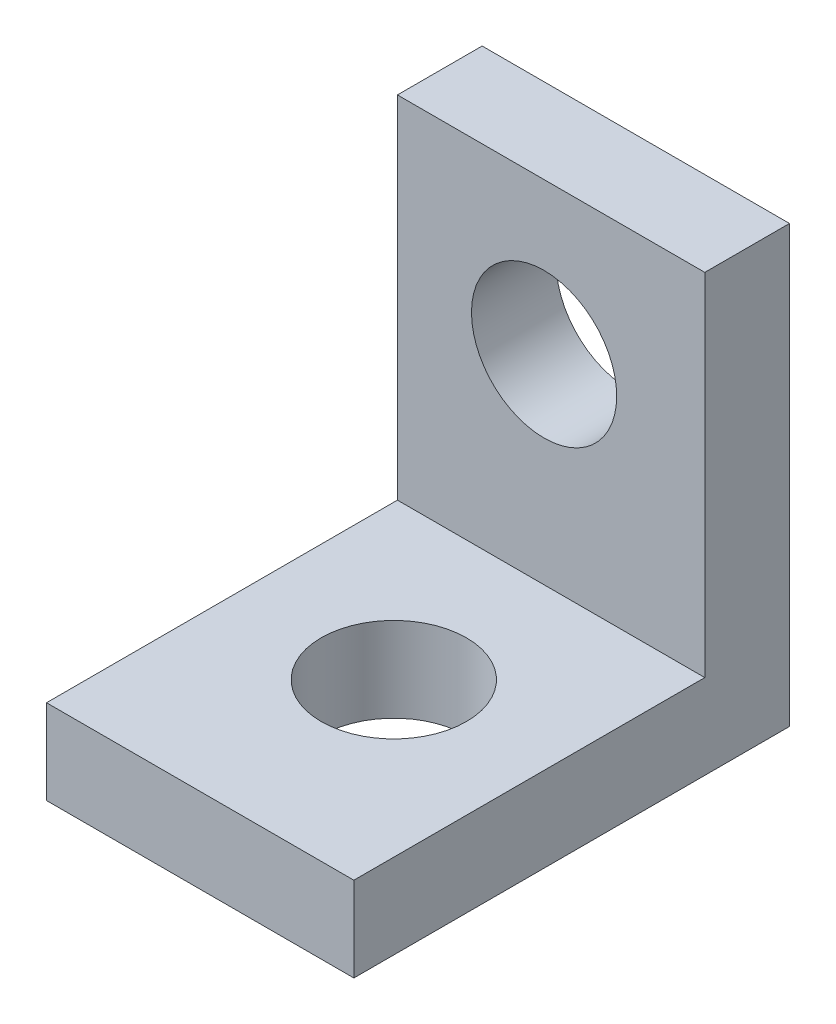
ISO-10303-21;
HEADER;
FILE_DESCRIPTION(('STEP AP214'),'2;1');
FILE_NAME('part.step','',(''),(''),'','','');
FILE_SCHEMA(('AUTOMOTIVE_DESIGN { 1 0 10303 214 1 1 1 1 }'));
ENDSEC;
DATA;
#1=APPLICATION_CONTEXT('core data for automotive mechanical design processes');
#2=APPLICATION_PROTOCOL_DEFINITION('international standard','automotive_design',2000,#1);
#3=PRODUCT_CONTEXT('',#1,'mechanical');
#4=PRODUCT('Part','Part','',(#3));
#5=PRODUCT_RELATED_PRODUCT_CATEGORY('part','',(#4));
#6=PRODUCT_DEFINITION_FORMATION('','',#4);
#7=PRODUCT_DEFINITION_CONTEXT('part definition',#1,'design');
#8=PRODUCT_DEFINITION('design','',#6,#7);
#9=PRODUCT_DEFINITION_SHAPE('','',#8);
#10=(LENGTH_UNIT() NAMED_UNIT(*) SI_UNIT(.MILLI.,.METRE.));
#11=(NAMED_UNIT(*) PLANE_ANGLE_UNIT() SI_UNIT($,.RADIAN.));
#12=(NAMED_UNIT(*) SI_UNIT($,.STERADIAN.) SOLID_ANGLE_UNIT());
#13=UNCERTAINTY_MEASURE_WITH_UNIT(LENGTH_MEASURE(1.E-05),#10,'distance_accuracy_value','');
#14=(GEOMETRIC_REPRESENTATION_CONTEXT(3) GLOBAL_UNCERTAINTY_ASSIGNED_CONTEXT((#13)) GLOBAL_UNIT_ASSIGNED_CONTEXT((#10,
#11,#12)) REPRESENTATION_CONTEXT('',''));
#15=CARTESIAN_POINT('',(0.,0.,0.));
#16=DIRECTION('',(0.,0.,1.));
#17=DIRECTION('',(1.,0.,0.));
#18=AXIS2_PLACEMENT_3D('',#15,#16,#17);
#19=CARTESIAN_POINT('',(0.,1.75,0.));
#20=DIRECTION('',(0.,1.,0.));
#21=DIRECTION('',(0.,0.,1.));
#22=AXIS2_PLACEMENT_3D('',#19,#20,#21);
#23=PLANE('',#22);
#24=DIRECTION('',(1.,0.,0.));
#25=VECTOR('',#24,1.);
#26=CARTESIAN_POINT('',(-0.604761904761905,1.75,-0.291071428571429));
#27=LINE('',#26,#25);
#28=CARTESIAN_POINT('',(-0.604761904761905,1.75,-0.291071428571429));
#29=VERTEX_POINT('',#28);
#30=CARTESIAN_POINT('',(5.74523809523809,1.75,-0.291071428571429));
#31=VERTEX_POINT('',#30);
#32=EDGE_CURVE('E56',#29,#31,#27,.T.);
#33=ORIENTED_EDGE('',*,*,#32,.F.);
#34=DIRECTION('',(0.,0.,1.));
#35=VECTOR('',#34,1.);
#36=CARTESIAN_POINT('',(-0.604761904761906,1.75,-2.04107142857143));
#37=LINE('',#36,#35);
#38=CARTESIAN_POINT('',(-0.604761904761905,1.75,6.95892857142857));
#39=VERTEX_POINT('',#38);
#40=EDGE_CURVE('E94',#29,#39,#37,.T.);
#41=ORIENTED_EDGE('',*,*,#40,.T.);
#42=DIRECTION('',(1.,0.,0.));
#43=VECTOR('',#42,1.);
#44=CARTESIAN_POINT('',(-0.604761904761905,1.75,6.95892857142857));
#45=LINE('',#44,#43);
#46=CARTESIAN_POINT('',(5.7452380952381,1.75,6.95892857142857));
#47=VERTEX_POINT('',#46);
#48=EDGE_CURVE('E62',#39,#47,#45,.T.);
#49=ORIENTED_EDGE('',*,*,#48,.T.);
#50=DIRECTION('',(0.,0.,-1.));
#51=VECTOR('',#50,1.);
#52=CARTESIAN_POINT('',(5.74523809523809,1.75,-2.04107142857143));
#53=LINE('',#52,#51);
#54=EDGE_CURVE('E106',#47,#31,#53,.T.);
#55=ORIENTED_EDGE('',*,*,#54,.T.);
#56=EDGE_LOOP('',(#33,#41,#49,#55));
#57=FACE_BOUND('',#56,.T.);
#58=CARTESIAN_POINT('',(2.57023809523809,1.75,2.95892857142857));
#59=DIRECTION('',(0.,1.,0.));
#60=DIRECTION('',(0.,0.,1.));
#61=AXIS2_PLACEMENT_3D('',#58,#59,#60);
#62=CIRCLE('',#61,1.5);
#63=CARTESIAN_POINT('',(2.57023809523809,1.75,4.45892857142857));
#64=VERTEX_POINT('',#63);
#65=EDGE_CURVE('E112',#64,#64,#62,.T.);
#66=ORIENTED_EDGE('',*,*,#65,.F.);
#67=EDGE_LOOP('',(#66));
#68=FACE_BOUND('',#67,.T.);
#69=ADVANCED_FACE('F39',(#57,#68),#23,.T.);
#70=CARTESIAN_POINT('',(0.,0.,0.));
#71=DIRECTION('',(0.,1.,0.));
#72=DIRECTION('',(0.,0.,1.));
#73=AXIS2_PLACEMENT_3D('',#70,#71,#72);
#74=PLANE('',#73);
#75=DIRECTION('',(0.,0.,1.));
#76=VECTOR('',#75,1.);
#77=CARTESIAN_POINT('',(-0.604761904761906,0.,-2.04107142857143));
#78=LINE('',#77,#76);
#79=CARTESIAN_POINT('',(-0.604761904761906,0.,-2.04107142857143));
#80=VERTEX_POINT('',#79);
#81=CARTESIAN_POINT('',(-0.604761904761905,0.,6.95892857142857));
#82=VERTEX_POINT('',#81);
#83=EDGE_CURVE('E101',#80,#82,#78,.T.);
#84=ORIENTED_EDGE('',*,*,#83,.F.);
#85=DIRECTION('',(-1.,0.,0.));
#86=VECTOR('',#85,1.);
#87=CARTESIAN_POINT('',(-0.604761904761906,0.,-2.04107142857143));
#88=LINE('',#87,#86);
#89=CARTESIAN_POINT('',(5.74523809523809,0.,-2.04107142857143));
#90=VERTEX_POINT('',#89);
#91=EDGE_CURVE('E82',#90,#80,#88,.T.);
#92=ORIENTED_EDGE('',*,*,#91,.F.);
#93=DIRECTION('',(0.,0.,-1.));
#94=VECTOR('',#93,1.);
#95=CARTESIAN_POINT('',(5.74523809523809,0.,-2.04107142857143));
#96=LINE('',#95,#94);
#97=CARTESIAN_POINT('',(5.7452380952381,0.,6.95892857142857));
#98=VERTEX_POINT('',#97);
#99=EDGE_CURVE('E95',#98,#90,#96,.T.);
#100=ORIENTED_EDGE('',*,*,#99,.F.);
#101=DIRECTION('',(1.,0.,0.));
#102=VECTOR('',#101,1.);
#103=CARTESIAN_POINT('',(-0.604761904761905,0.,6.95892857142857));
#104=LINE('',#103,#102);
#105=EDGE_CURVE('E110',#82,#98,#104,.T.);
#106=ORIENTED_EDGE('',*,*,#105,.F.);
#107=EDGE_LOOP('',(#84,#92,#100,#106));
#108=FACE_BOUND('',#107,.T.);
#109=CARTESIAN_POINT('',(2.57023809523809,0.,2.95892857142857));
#110=DIRECTION('',(0.,1.,0.));
#111=DIRECTION('',(0.,0.,1.));
#112=AXIS2_PLACEMENT_3D('',#109,#110,#111);
#113=CIRCLE('',#112,1.5);
#114=CARTESIAN_POINT('',(2.57023809523809,0.,4.45892857142857));
#115=VERTEX_POINT('',#114);
#116=EDGE_CURVE('E118',#115,#115,#113,.T.);
#117=ORIENTED_EDGE('',*,*,#116,.T.);
#118=EDGE_LOOP('',(#117));
#119=FACE_BOUND('',#118,.T.);
#120=ADVANCED_FACE('F108',(#108,#119),#74,.F.);
#121=CARTESIAN_POINT('',(-0.604761904761906,1.75,-2.04107142857143));
#122=DIRECTION('',(1.,0.,0.));
#123=DIRECTION('',(0.,0.,-1.));
#124=AXIS2_PLACEMENT_3D('',#121,#122,#123);
#125=PLANE('',#124);
#126=ORIENTED_EDGE('',*,*,#83,.T.);
#127=DIRECTION('',(0.,-1.,0.));
#128=VECTOR('',#127,1.);
#129=CARTESIAN_POINT('',(-0.604761904761905,1.75,6.95892857142857));
#130=LINE('',#129,#128);
#131=EDGE_CURVE('E11',#39,#82,#130,.T.);
#132=ORIENTED_EDGE('',*,*,#131,.F.);
#133=ORIENTED_EDGE('',*,*,#40,.F.);
#134=DIRECTION('',(0.,-1.,0.));
#135=VECTOR('',#134,1.);
#136=CARTESIAN_POINT('',(-0.604761904761905,9.,-0.291071428571429));
#137=LINE('',#136,#135);
#138=CARTESIAN_POINT('',(-0.604761904761905,9.,-0.291071428571429));
#139=VERTEX_POINT('',#138);
#140=EDGE_CURVE('E137',#139,#29,#137,.T.);
#141=ORIENTED_EDGE('',*,*,#140,.F.);
#142=DIRECTION('',(0.,0.,1.));
#143=VECTOR('',#142,1.);
#144=CARTESIAN_POINT('',(-0.604761904761906,9.,-2.04107142857143));
#145=LINE('',#144,#143);
#146=CARTESIAN_POINT('',(-0.604761904761906,9.,-2.04107142857143));
#147=VERTEX_POINT('',#146);
#148=EDGE_CURVE('E104',#147,#139,#145,.T.);
#149=ORIENTED_EDGE('',*,*,#148,.F.);
#150=DIRECTION('',(0.,-1.,0.));
#151=VECTOR('',#150,1.);
#152=CARTESIAN_POINT('',(-0.604761904761906,1.75,-2.04107142857143));
#153=LINE('',#152,#151);
#154=EDGE_CURVE('E86',#147,#80,#153,.T.);
#155=ORIENTED_EDGE('',*,*,#154,.T.);
#156=EDGE_LOOP('',(#126,#132,#133,#141,#149,#155));
#157=FACE_BOUND('',#156,.T.);
#158=ADVANCED_FACE('F41',(#157),#125,.F.);
#159=CARTESIAN_POINT('',(-0.604761904761905,1.75,6.95892857142857));
#160=DIRECTION('',(0.,0.,-1.));
#161=DIRECTION('',(-1.,0.,0.));
#162=AXIS2_PLACEMENT_3D('',#159,#160,#161);
#163=PLANE('',#162);
#164=ORIENTED_EDGE('',*,*,#105,.T.);
#165=DIRECTION('',(0.,-1.,0.));
#166=VECTOR('',#165,1.);
#167=CARTESIAN_POINT('',(5.7452380952381,1.75,6.95892857142857));
#168=LINE('',#167,#166);
#169=EDGE_CURVE('E49',#47,#98,#168,.T.);
#170=ORIENTED_EDGE('',*,*,#169,.F.);
#171=ORIENTED_EDGE('',*,*,#48,.F.);
#172=ORIENTED_EDGE('',*,*,#131,.T.);
#173=EDGE_LOOP('',(#164,#170,#171,#172));
#174=FACE_BOUND('',#173,.T.);
#175=ADVANCED_FACE('F134',(#174),#163,.F.);
#176=CARTESIAN_POINT('',(5.74523809523809,1.75,-2.04107142857143));
#177=DIRECTION('',(-1.,0.,0.));
#178=DIRECTION('',(0.,0.,1.));
#179=AXIS2_PLACEMENT_3D('',#176,#177,#178);
#180=PLANE('',#179);
#181=ORIENTED_EDGE('',*,*,#99,.T.);
#182=DIRECTION('',(0.,-1.,0.));
#183=VECTOR('',#182,1.);
#184=CARTESIAN_POINT('',(5.74523809523809,1.75,-2.04107142857143));
#185=LINE('',#184,#183);
#186=CARTESIAN_POINT('',(5.74523809523809,9.,-2.04107142857143));
#187=VERTEX_POINT('',#186);
#188=EDGE_CURVE('E89',#187,#90,#185,.T.);
#189=ORIENTED_EDGE('',*,*,#188,.F.);
#190=DIRECTION('',(0.,0.,-1.));
#191=VECTOR('',#190,1.);
#192=CARTESIAN_POINT('',(5.74523809523809,9.,-2.04107142857143));
#193=LINE('',#192,#191);
#194=CARTESIAN_POINT('',(5.74523809523809,9.,-0.291071428571429));
#195=VERTEX_POINT('',#194);
#196=EDGE_CURVE('E170',#195,#187,#193,.T.);
#197=ORIENTED_EDGE('',*,*,#196,.F.);
#198=DIRECTION('',(0.,-1.,0.));
#199=VECTOR('',#198,1.);
#200=CARTESIAN_POINT('',(5.74523809523809,9.,-0.291071428571429));
#201=LINE('',#200,#199);
#202=EDGE_CURVE('E148',#195,#31,#201,.T.);
#203=ORIENTED_EDGE('',*,*,#202,.T.);
#204=ORIENTED_EDGE('',*,*,#54,.F.);
#205=ORIENTED_EDGE('',*,*,#169,.T.);
#206=EDGE_LOOP('',(#181,#189,#197,#203,#204,#205));
#207=FACE_BOUND('',#206,.T.);
#208=ADVANCED_FACE('F131',(#207),#180,.F.);
#209=CARTESIAN_POINT('',(-0.604761904761906,1.75,-2.04107142857143));
#210=DIRECTION('',(0.,0.,1.));
#211=DIRECTION('',(1.,0.,0.));
#212=AXIS2_PLACEMENT_3D('',#209,#210,#211);
#213=PLANE('',#212);
#214=CARTESIAN_POINT('',(2.42523809523809,5.875,-2.04107142857143));
#215=DIRECTION('',(0.,0.,1.));
#216=DIRECTION('',(1.,0.,0.));
#217=AXIS2_PLACEMENT_3D('',#214,#215,#216);
#218=CIRCLE('',#217,1.5);
#219=CARTESIAN_POINT('',(3.92523809523809,5.875,-2.04107142857143));
#220=VERTEX_POINT('',#219);
#221=EDGE_CURVE('E182',#220,#220,#218,.T.);
#222=ORIENTED_EDGE('',*,*,#221,.T.);
#223=EDGE_LOOP('',(#222));
#224=FACE_BOUND('',#223,.T.);
#225=ORIENTED_EDGE('',*,*,#91,.T.);
#226=ORIENTED_EDGE('',*,*,#154,.F.);
#227=DIRECTION('',(-1.,0.,0.));
#228=VECTOR('',#227,1.);
#229=CARTESIAN_POINT('',(-0.604761904761906,9.,-2.04107142857143));
#230=LINE('',#229,#228);
#231=EDGE_CURVE('E154',#187,#147,#230,.T.);
#232=ORIENTED_EDGE('',*,*,#231,.F.);
#233=ORIENTED_EDGE('',*,*,#188,.T.);
#234=EDGE_LOOP('',(#225,#226,#232,#233));
#235=FACE_BOUND('',#234,.T.);
#236=ADVANCED_FACE('F84',(#224,#235),#213,.F.);
#237=CARTESIAN_POINT('',(2.57023809523809,1.75,2.95892857142857));
#238=DIRECTION('',(0.,-1.,0.));
#239=DIRECTION('',(0.,0.,-1.));
#240=AXIS2_PLACEMENT_3D('',#237,#238,#239);
#241=CYLINDRICAL_SURFACE('',#240,1.5);
#242=ORIENTED_EDGE('',*,*,#65,.T.);
#243=EDGE_LOOP('',(#242));
#244=FACE_BOUND('',#243,.T.);
#245=ORIENTED_EDGE('',*,*,#116,.F.);
#246=EDGE_LOOP('',(#245));
#247=FACE_BOUND('',#246,.T.);
#248=ADVANCED_FACE('F206',(#244,#247),#241,.F.);
#249=CARTESIAN_POINT('',(-0.604761904761905,9.,-0.291071428571429));
#250=DIRECTION('',(0.,0.,-1.));
#251=DIRECTION('',(-1.,0.,0.));
#252=AXIS2_PLACEMENT_3D('',#249,#250,#251);
#253=PLANE('',#252);
#254=CARTESIAN_POINT('',(2.42523809523809,5.875,-0.291071428571429));
#255=DIRECTION('',(0.,0.,-1.));
#256=DIRECTION('',(-1.,0.,0.));
#257=AXIS2_PLACEMENT_3D('',#254,#255,#256);
#258=CIRCLE('',#257,1.5);
#259=CARTESIAN_POINT('',(0.925238095238093,5.875,-0.291071428571429));
#260=VERTEX_POINT('',#259);
#261=EDGE_CURVE('E43',#260,#260,#258,.T.);
#262=ORIENTED_EDGE('',*,*,#261,.T.);
#263=EDGE_LOOP('',(#262));
#264=FACE_BOUND('',#263,.T.);
#265=ORIENTED_EDGE('',*,*,#32,.T.);
#266=ORIENTED_EDGE('',*,*,#202,.F.);
#267=DIRECTION('',(1.,0.,0.));
#268=VECTOR('',#267,1.);
#269=CARTESIAN_POINT('',(-0.604761904761905,9.,-0.291071428571429));
#270=LINE('',#269,#268);
#271=EDGE_CURVE('E146',#139,#195,#270,.T.);
#272=ORIENTED_EDGE('',*,*,#271,.F.);
#273=ORIENTED_EDGE('',*,*,#140,.T.);
#274=EDGE_LOOP('',(#265,#266,#272,#273));
#275=FACE_BOUND('',#274,.T.);
#276=ADVANCED_FACE('F142',(#264,#275),#253,.F.);
#277=CARTESIAN_POINT('',(0.,9.,0.));
#278=DIRECTION('',(0.,1.,0.));
#279=DIRECTION('',(0.,0.,1.));
#280=AXIS2_PLACEMENT_3D('',#277,#278,#279);
#281=PLANE('',#280);
#282=ORIENTED_EDGE('',*,*,#148,.T.);
#283=ORIENTED_EDGE('',*,*,#271,.T.);
#284=ORIENTED_EDGE('',*,*,#196,.T.);
#285=ORIENTED_EDGE('',*,*,#231,.T.);
#286=EDGE_LOOP('',(#282,#283,#284,#285));
#287=FACE_BOUND('',#286,.T.);
#288=ADVANCED_FACE('F168',(#287),#281,.T.);
#289=CARTESIAN_POINT('',(2.42523809523809,5.875,-2.04107142857143));
#290=DIRECTION('',(0.,0.,1.));
#291=DIRECTION('',(1.,0.,0.));
#292=AXIS2_PLACEMENT_3D('',#289,#290,#291);
#293=CYLINDRICAL_SURFACE('',#292,1.5);
#294=ORIENTED_EDGE('',*,*,#221,.F.);
#295=EDGE_LOOP('',(#294));
#296=FACE_BOUND('',#295,.T.);
#297=ORIENTED_EDGE('',*,*,#261,.F.);
#298=EDGE_LOOP('',(#297));
#299=FACE_BOUND('',#298,.T.);
#300=ADVANCED_FACE('F191',(#296,#299),#293,.F.);
#301=CLOSED_SHELL('',(#69,#120,#158,#175,#208,#236,#248,#276,#288,#300));
#302=MANIFOLD_SOLID_BREP('B2',#301);
#303=ADVANCED_BREP_SHAPE_REPRESENTATION('',(#18,#302),#14);
#304=SHAPE_DEFINITION_REPRESENTATION(#9,#303);
ENDSEC;
END-ISO-10303-21;
